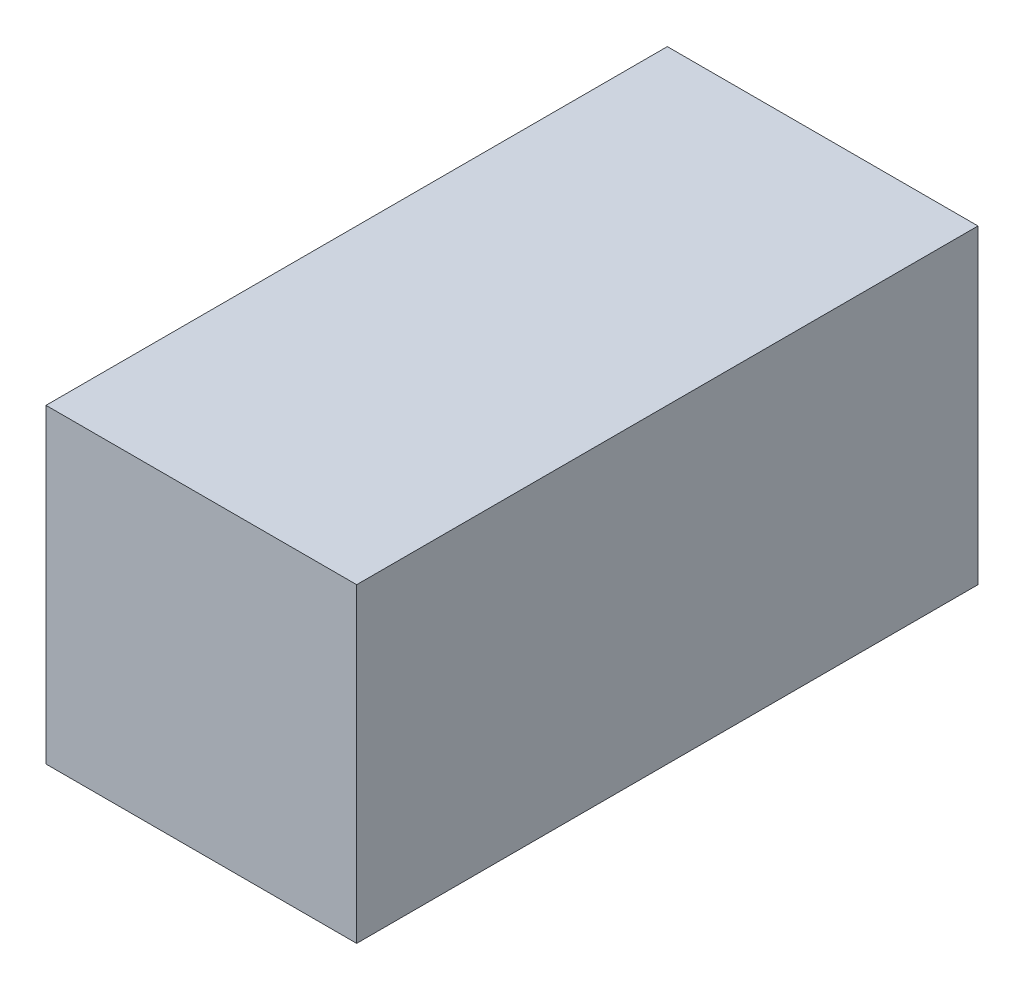
ISO-10303-21;
HEADER;
FILE_DESCRIPTION(('STEP AP214'),'2;1');
FILE_NAME('part.step','',(''),(''),'','','');
FILE_SCHEMA(('AUTOMOTIVE_DESIGN { 1 0 10303 214 1 1 1 1 }'));
ENDSEC;
DATA;
#1=APPLICATION_CONTEXT('core data for automotive mechanical design processes');
#2=APPLICATION_PROTOCOL_DEFINITION('international standard','automotive_design',2000,#1);
#3=PRODUCT_CONTEXT('',#1,'mechanical');
#4=PRODUCT('Part','Part','',(#3));
#5=PRODUCT_RELATED_PRODUCT_CATEGORY('part','',(#4));
#6=PRODUCT_DEFINITION_FORMATION('','',#4);
#7=PRODUCT_DEFINITION_CONTEXT('part definition',#1,'design');
#8=PRODUCT_DEFINITION('design','',#6,#7);
#9=PRODUCT_DEFINITION_SHAPE('','',#8);
#10=(LENGTH_UNIT() NAMED_UNIT(*) SI_UNIT(.MILLI.,.METRE.));
#11=(NAMED_UNIT(*) PLANE_ANGLE_UNIT() SI_UNIT($,.RADIAN.));
#12=(NAMED_UNIT(*) SI_UNIT($,.STERADIAN.) SOLID_ANGLE_UNIT());
#13=UNCERTAINTY_MEASURE_WITH_UNIT(LENGTH_MEASURE(1.E-05),#10,'distance_accuracy_value','');
#14=(GEOMETRIC_REPRESENTATION_CONTEXT(3) GLOBAL_UNCERTAINTY_ASSIGNED_CONTEXT((#13)) GLOBAL_UNIT_ASSIGNED_CONTEXT((#10,
#11,#12)) REPRESENTATION_CONTEXT('',''));
#15=CARTESIAN_POINT('',(0.,0.,0.));
#16=DIRECTION('',(0.,0.,1.));
#17=DIRECTION('',(1.,0.,0.));
#18=AXIS2_PLACEMENT_3D('',#15,#16,#17);
#19=CARTESIAN_POINT('',(0.,0.,-44.));
#20=DIRECTION('',(-1.,0.,0.));
#21=DIRECTION('',(0.,0.,1.));
#22=AXIS2_PLACEMENT_3D('',#19,#20,#21);
#23=PLANE('',#22);
#24=DIRECTION('',(0.,-1.,0.));
#25=VECTOR('',#24,1.);
#26=CARTESIAN_POINT('',(0.,0.,0.));
#27=LINE('',#26,#25);
#28=CARTESIAN_POINT('',(0.,22.,0.));
#29=VERTEX_POINT('',#28);
#30=CARTESIAN_POINT('',(0.,0.,0.));
#31=VERTEX_POINT('',#30);
#32=EDGE_CURVE('E95',#29,#31,#27,.T.);
#33=ORIENTED_EDGE('',*,*,#32,.F.);
#34=DIRECTION('',(0.,0.,1.));
#35=VECTOR('',#34,1.);
#36=CARTESIAN_POINT('',(0.,22.,-44.));
#37=LINE('',#36,#35);
#38=CARTESIAN_POINT('',(0.,22.,-44.));
#39=VERTEX_POINT('',#38);
#40=EDGE_CURVE('E11',#39,#29,#37,.T.);
#41=ORIENTED_EDGE('',*,*,#40,.F.);
#42=DIRECTION('',(0.,-1.,0.));
#43=VECTOR('',#42,1.);
#44=CARTESIAN_POINT('',(0.,0.,-44.));
#45=LINE('',#44,#43);
#46=CARTESIAN_POINT('',(0.,0.,-44.));
#47=VERTEX_POINT('',#46);
#48=EDGE_CURVE('E89',#39,#47,#45,.T.);
#49=ORIENTED_EDGE('',*,*,#48,.T.);
#50=DIRECTION('',(0.,0.,1.));
#51=VECTOR('',#50,1.);
#52=CARTESIAN_POINT('',(0.,0.,-44.));
#53=LINE('',#52,#51);
#54=EDGE_CURVE('E34',#47,#31,#53,.T.);
#55=ORIENTED_EDGE('',*,*,#54,.T.);
#56=EDGE_LOOP('',(#33,#41,#49,#55));
#57=FACE_BOUND('',#56,.T.);
#58=ADVANCED_FACE('F31',(#57),#23,.T.);
#59=CARTESIAN_POINT('',(0.,22.,-44.));
#60=DIRECTION('',(0.,1.,0.));
#61=DIRECTION('',(0.,0.,1.));
#62=AXIS2_PLACEMENT_3D('',#59,#60,#61);
#63=PLANE('',#62);
#64=DIRECTION('',(-1.,0.,0.));
#65=VECTOR('',#64,1.);
#66=CARTESIAN_POINT('',(0.,22.,0.));
#67=LINE('',#66,#65);
#68=CARTESIAN_POINT('',(22.,22.,0.));
#69=VERTEX_POINT('',#68);
#70=EDGE_CURVE('E91',#69,#29,#67,.T.);
#71=ORIENTED_EDGE('',*,*,#70,.F.);
#72=DIRECTION('',(0.,0.,1.));
#73=VECTOR('',#72,1.);
#74=CARTESIAN_POINT('',(22.,22.,-44.));
#75=LINE('',#74,#73);
#76=CARTESIAN_POINT('',(22.,22.,-44.));
#77=VERTEX_POINT('',#76);
#78=EDGE_CURVE('E40',#77,#69,#75,.T.);
#79=ORIENTED_EDGE('',*,*,#78,.F.);
#80=DIRECTION('',(-1.,0.,0.));
#81=VECTOR('',#80,1.);
#82=CARTESIAN_POINT('',(0.,22.,-44.));
#83=LINE('',#82,#81);
#84=EDGE_CURVE('E86',#77,#39,#83,.T.);
#85=ORIENTED_EDGE('',*,*,#84,.T.);
#86=ORIENTED_EDGE('',*,*,#40,.T.);
#87=EDGE_LOOP('',(#71,#79,#85,#86));
#88=FACE_BOUND('',#87,.T.);
#89=ADVANCED_FACE('F105',(#88),#63,.T.);
#90=CARTESIAN_POINT('',(22.,0.,-44.));
#91=DIRECTION('',(1.,0.,0.));
#92=DIRECTION('',(0.,0.,-1.));
#93=AXIS2_PLACEMENT_3D('',#90,#91,#92);
#94=PLANE('',#93);
#95=DIRECTION('',(0.,1.,0.));
#96=VECTOR('',#95,1.);
#97=CARTESIAN_POINT('',(22.,0.,0.));
#98=LINE('',#97,#96);
#99=CARTESIAN_POINT('',(22.,0.,0.));
#100=VERTEX_POINT('',#99);
#101=EDGE_CURVE('E81',#100,#69,#98,.T.);
#102=ORIENTED_EDGE('',*,*,#101,.F.);
#103=DIRECTION('',(0.,0.,1.));
#104=VECTOR('',#103,1.);
#105=CARTESIAN_POINT('',(22.,0.,-44.));
#106=LINE('',#105,#104);
#107=CARTESIAN_POINT('',(22.,0.,-44.));
#108=VERTEX_POINT('',#107);
#109=EDGE_CURVE('E76',#108,#100,#106,.T.);
#110=ORIENTED_EDGE('',*,*,#109,.F.);
#111=DIRECTION('',(0.,1.,0.));
#112=VECTOR('',#111,1.);
#113=CARTESIAN_POINT('',(22.,0.,-44.));
#114=LINE('',#113,#112);
#115=EDGE_CURVE('E79',#108,#77,#114,.T.);
#116=ORIENTED_EDGE('',*,*,#115,.T.);
#117=ORIENTED_EDGE('',*,*,#78,.T.);
#118=EDGE_LOOP('',(#102,#110,#116,#117));
#119=FACE_BOUND('',#118,.T.);
#120=ADVANCED_FACE('F78',(#119),#94,.T.);
#121=CARTESIAN_POINT('',(0.,0.,-44.));
#122=DIRECTION('',(0.,-1.,0.));
#123=DIRECTION('',(0.,0.,-1.));
#124=AXIS2_PLACEMENT_3D('',#121,#122,#123);
#125=PLANE('',#124);
#126=DIRECTION('',(1.,0.,0.));
#127=VECTOR('',#126,1.);
#128=CARTESIAN_POINT('',(0.,0.,0.));
#129=LINE('',#128,#127);
#130=EDGE_CURVE('E98',#31,#100,#129,.T.);
#131=ORIENTED_EDGE('',*,*,#130,.F.);
#132=ORIENTED_EDGE('',*,*,#54,.F.);
#133=DIRECTION('',(1.,0.,0.));
#134=VECTOR('',#133,1.);
#135=CARTESIAN_POINT('',(0.,0.,-44.));
#136=LINE('',#135,#134);
#137=EDGE_CURVE('E85',#47,#108,#136,.T.);
#138=ORIENTED_EDGE('',*,*,#137,.T.);
#139=ORIENTED_EDGE('',*,*,#109,.T.);
#140=EDGE_LOOP('',(#131,#132,#138,#139));
#141=FACE_BOUND('',#140,.T.);
#142=ADVANCED_FACE('F88',(#141),#125,.T.);
#143=CARTESIAN_POINT('',(0.,22.,-44.));
#144=DIRECTION('',(0.,0.,-1.));
#145=DIRECTION('',(-1.,0.,0.));
#146=AXIS2_PLACEMENT_3D('',#143,#144,#145);
#147=PLANE('',#146);
#148=ORIENTED_EDGE('',*,*,#48,.F.);
#149=ORIENTED_EDGE('',*,*,#84,.F.);
#150=ORIENTED_EDGE('',*,*,#115,.F.);
#151=ORIENTED_EDGE('',*,*,#137,.F.);
#152=EDGE_LOOP('',(#148,#149,#150,#151));
#153=FACE_BOUND('',#152,.T.);
#154=ADVANCED_FACE('F84',(#153),#147,.T.);
#155=CARTESIAN_POINT('',(0.,22.,0.));
#156=DIRECTION('',(0.,0.,-1.));
#157=DIRECTION('',(-1.,0.,0.));
#158=AXIS2_PLACEMENT_3D('',#155,#156,#157);
#159=PLANE('',#158);
#160=ORIENTED_EDGE('',*,*,#32,.T.);
#161=ORIENTED_EDGE('',*,*,#130,.T.);
#162=ORIENTED_EDGE('',*,*,#101,.T.);
#163=ORIENTED_EDGE('',*,*,#70,.T.);
#164=EDGE_LOOP('',(#160,#161,#162,#163));
#165=FACE_BOUND('',#164,.T.);
#166=ADVANCED_FACE('F104',(#165),#159,.F.);
#167=CLOSED_SHELL('',(#58,#89,#120,#142,#154,#166));
#168=MANIFOLD_SOLID_BREP('B2',#167);
#169=ADVANCED_BREP_SHAPE_REPRESENTATION('',(#18,#168),#14);
#170=SHAPE_DEFINITION_REPRESENTATION(#9,#169);
ENDSEC;
END-ISO-10303-21;
